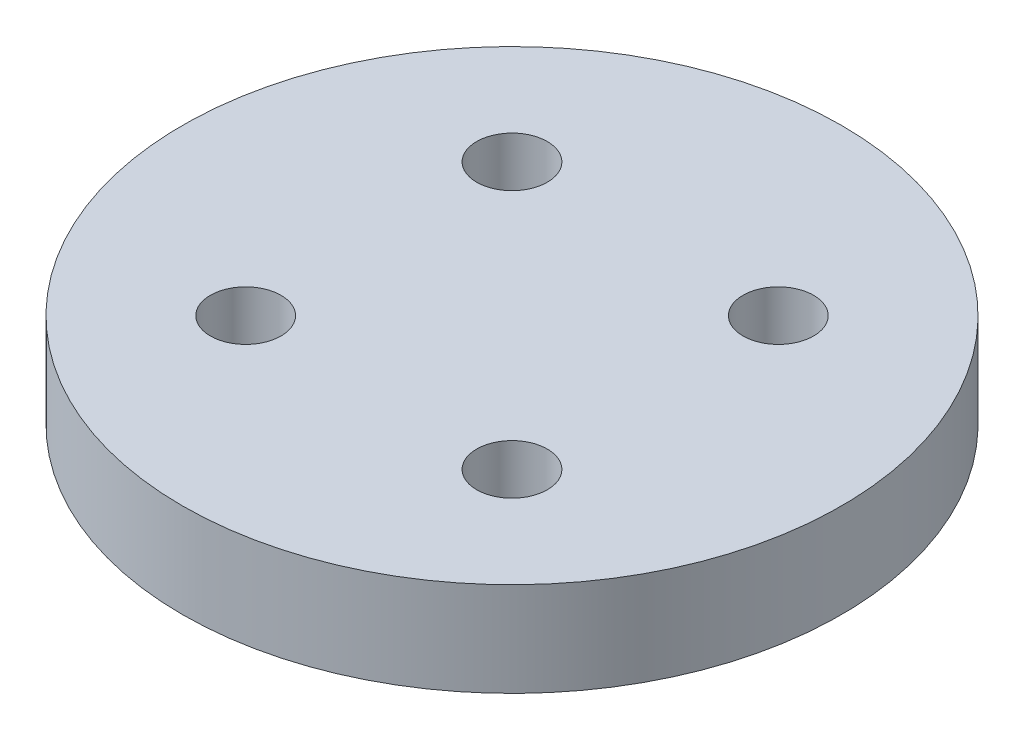
ISO-10303-21;
HEADER;
FILE_DESCRIPTION(('STEP AP214'),'2;1');
FILE_NAME('part.step','',(''),(''),'','','');
FILE_SCHEMA(('AUTOMOTIVE_DESIGN { 1 0 10303 214 1 1 1 1 }'));
ENDSEC;
DATA;
#1=APPLICATION_CONTEXT('core data for automotive mechanical design processes');
#2=APPLICATION_PROTOCOL_DEFINITION('international standard','automotive_design',2000,#1);
#3=PRODUCT_CONTEXT('',#1,'mechanical');
#4=PRODUCT('Part','Part','',(#3));
#5=PRODUCT_RELATED_PRODUCT_CATEGORY('part','',(#4));
#6=PRODUCT_DEFINITION_FORMATION('','',#4);
#7=PRODUCT_DEFINITION_CONTEXT('part definition',#1,'design');
#8=PRODUCT_DEFINITION('design','',#6,#7);
#9=PRODUCT_DEFINITION_SHAPE('','',#8);
#10=(LENGTH_UNIT() NAMED_UNIT(*) SI_UNIT(.MILLI.,.METRE.));
#11=(NAMED_UNIT(*) PLANE_ANGLE_UNIT() SI_UNIT($,.RADIAN.));
#12=(NAMED_UNIT(*) SI_UNIT($,.STERADIAN.) SOLID_ANGLE_UNIT());
#13=UNCERTAINTY_MEASURE_WITH_UNIT(LENGTH_MEASURE(1.E-05),#10,'distance_accuracy_value','');
#14=(GEOMETRIC_REPRESENTATION_CONTEXT(3) GLOBAL_UNCERTAINTY_ASSIGNED_CONTEXT((#13)) GLOBAL_UNIT_ASSIGNED_CONTEXT((#10,
#11,#12)) REPRESENTATION_CONTEXT('',''));
#15=CARTESIAN_POINT('',(0.,0.,0.));
#16=DIRECTION('',(0.,0.,1.));
#17=DIRECTION('',(1.,0.,0.));
#18=AXIS2_PLACEMENT_3D('',#15,#16,#17);
#19=CARTESIAN_POINT('',(0.,4.,0.));
#20=DIRECTION('',(0.,1.,0.));
#21=DIRECTION('',(0.,0.,1.));
#22=AXIS2_PLACEMENT_3D('',#19,#20,#21);
#23=PLANE('',#22);
#24=CARTESIAN_POINT('',(5.65685424949238,4.,5.65685424949238));
#25=DIRECTION('',(0.,1.,0.));
#26=DIRECTION('',(0.,0.,1.));
#27=AXIS2_PLACEMENT_3D('',#24,#25,#26);
#28=CIRCLE('',#27,1.5);
#29=CARTESIAN_POINT('',(5.65685424949238,4.,7.15685424949238));
#30=VERTEX_POINT('',#29);
#31=EDGE_CURVE('E57',#30,#30,#28,.T.);
#32=ORIENTED_EDGE('',*,*,#31,.F.);
#33=EDGE_LOOP('',(#32));
#34=FACE_BOUND('',#33,.T.);
#35=CARTESIAN_POINT('',(-5.65685424949238,4.,-5.65685424949238));
#36=DIRECTION('',(0.,1.,0.));
#37=DIRECTION('',(0.,0.,1.));
#38=AXIS2_PLACEMENT_3D('',#35,#36,#37);
#39=CIRCLE('',#38,1.5);
#40=CARTESIAN_POINT('',(-5.65685424949238,4.,-4.15685424949238));
#41=VERTEX_POINT('',#40);
#42=EDGE_CURVE('E46',#41,#41,#39,.T.);
#43=ORIENTED_EDGE('',*,*,#42,.F.);
#44=EDGE_LOOP('',(#43));
#45=FACE_BOUND('',#44,.T.);
#46=CARTESIAN_POINT('',(0.,4.,0.));
#47=DIRECTION('',(0.,1.,0.));
#48=DIRECTION('',(0.,0.,1.));
#49=AXIS2_PLACEMENT_3D('',#46,#47,#48);
#50=CIRCLE('',#49,14.);
#51=CARTESIAN_POINT('',(0.,4.,14.));
#52=VERTEX_POINT('',#51);
#53=EDGE_CURVE('E10',#52,#52,#50,.T.);
#54=ORIENTED_EDGE('',*,*,#53,.T.);
#55=EDGE_LOOP('',(#54));
#56=FACE_BOUND('',#55,.T.);
#57=CARTESIAN_POINT('',(5.65685424949238,4.,-5.65685424949238));
#58=DIRECTION('',(0.,1.,0.));
#59=DIRECTION('',(0.,0.,1.));
#60=AXIS2_PLACEMENT_3D('',#57,#58,#59);
#61=CIRCLE('',#60,1.5);
#62=CARTESIAN_POINT('',(5.65685424949238,4.,-4.15685424949238));
#63=VERTEX_POINT('',#62);
#64=EDGE_CURVE('E51',#63,#63,#61,.T.);
#65=ORIENTED_EDGE('',*,*,#64,.F.);
#66=EDGE_LOOP('',(#65));
#67=FACE_BOUND('',#66,.T.);
#68=CARTESIAN_POINT('',(-5.65685424949238,4.,5.65685424949238));
#69=DIRECTION('',(0.,1.,0.));
#70=DIRECTION('',(0.,0.,1.));
#71=AXIS2_PLACEMENT_3D('',#68,#69,#70);
#72=CIRCLE('',#71,1.5);
#73=CARTESIAN_POINT('',(-5.65685424949238,4.,7.15685424949238));
#74=VERTEX_POINT('',#73);
#75=EDGE_CURVE('E63',#74,#74,#72,.T.);
#76=ORIENTED_EDGE('',*,*,#75,.F.);
#77=EDGE_LOOP('',(#76));
#78=FACE_BOUND('',#77,.T.);
#79=ADVANCED_FACE('F35',(#34,#45,#56,#67,#78),#23,.T.);
#80=CARTESIAN_POINT('',(0.,0.,0.));
#81=DIRECTION('',(0.,1.,0.));
#82=DIRECTION('',(0.,0.,1.));
#83=AXIS2_PLACEMENT_3D('',#80,#81,#82);
#84=PLANE('',#83);
#85=CARTESIAN_POINT('',(0.,0.,0.));
#86=DIRECTION('',(0.,1.,0.));
#87=DIRECTION('',(0.,0.,1.));
#88=AXIS2_PLACEMENT_3D('',#85,#86,#87);
#89=CIRCLE('',#88,14.);
#90=CARTESIAN_POINT('',(0.,0.,14.));
#91=VERTEX_POINT('',#90);
#92=EDGE_CURVE('E39',#91,#91,#89,.T.);
#93=ORIENTED_EDGE('',*,*,#92,.F.);
#94=EDGE_LOOP('',(#93));
#95=FACE_BOUND('',#94,.T.);
#96=CARTESIAN_POINT('',(-5.65685424949238,0.,-5.65685424949238));
#97=DIRECTION('',(0.,1.,0.));
#98=DIRECTION('',(0.,0.,1.));
#99=AXIS2_PLACEMENT_3D('',#96,#97,#98);
#100=CIRCLE('',#99,1.5);
#101=CARTESIAN_POINT('',(-5.65685424949238,0.,-4.15685424949238));
#102=VERTEX_POINT('',#101);
#103=EDGE_CURVE('E48',#102,#102,#100,.T.);
#104=ORIENTED_EDGE('',*,*,#103,.T.);
#105=EDGE_LOOP('',(#104));
#106=FACE_BOUND('',#105,.T.);
#107=CARTESIAN_POINT('',(5.65685424949238,0.,-5.65685424949238));
#108=DIRECTION('',(0.,1.,0.));
#109=DIRECTION('',(0.,0.,1.));
#110=AXIS2_PLACEMENT_3D('',#107,#108,#109);
#111=CIRCLE('',#110,1.5);
#112=CARTESIAN_POINT('',(5.65685424949238,0.,-4.15685424949238));
#113=VERTEX_POINT('',#112);
#114=EDGE_CURVE('E54',#113,#113,#111,.T.);
#115=ORIENTED_EDGE('',*,*,#114,.T.);
#116=EDGE_LOOP('',(#115));
#117=FACE_BOUND('',#116,.T.);
#118=CARTESIAN_POINT('',(5.65685424949238,0.,5.65685424949238));
#119=DIRECTION('',(0.,1.,0.));
#120=DIRECTION('',(0.,0.,1.));
#121=AXIS2_PLACEMENT_3D('',#118,#119,#120);
#122=CIRCLE('',#121,1.5);
#123=CARTESIAN_POINT('',(5.65685424949238,0.,7.15685424949238));
#124=VERTEX_POINT('',#123);
#125=EDGE_CURVE('E60',#124,#124,#122,.T.);
#126=ORIENTED_EDGE('',*,*,#125,.T.);
#127=EDGE_LOOP('',(#126));
#128=FACE_BOUND('',#127,.T.);
#129=CARTESIAN_POINT('',(-5.65685424949238,0.,5.65685424949238));
#130=DIRECTION('',(0.,1.,0.));
#131=DIRECTION('',(0.,0.,1.));
#132=AXIS2_PLACEMENT_3D('',#129,#130,#131);
#133=CIRCLE('',#132,1.5);
#134=CARTESIAN_POINT('',(-5.65685424949238,0.,7.15685424949238));
#135=VERTEX_POINT('',#134);
#136=EDGE_CURVE('E66',#135,#135,#133,.T.);
#137=ORIENTED_EDGE('',*,*,#136,.T.);
#138=EDGE_LOOP('',(#137));
#139=FACE_BOUND('',#138,.T.);
#140=ADVANCED_FACE('F76',(#95,#106,#117,#128,#139),#84,.F.);
#141=CARTESIAN_POINT('',(0.,4.,0.));
#142=DIRECTION('',(0.,-1.,0.));
#143=DIRECTION('',(0.,0.,-1.));
#144=AXIS2_PLACEMENT_3D('',#141,#142,#143);
#145=CYLINDRICAL_SURFACE('',#144,14.);
#146=ORIENTED_EDGE('',*,*,#53,.F.);
#147=EDGE_LOOP('',(#146));
#148=FACE_BOUND('',#147,.T.);
#149=ORIENTED_EDGE('',*,*,#92,.T.);
#150=EDGE_LOOP('',(#149));
#151=FACE_BOUND('',#150,.T.);
#152=ADVANCED_FACE('F37',(#148,#151),#145,.T.);
#153=CARTESIAN_POINT('',(-5.65685424949238,4.,-5.65685424949238));
#154=DIRECTION('',(0.,-1.,0.));
#155=DIRECTION('',(0.,0.,-1.));
#156=AXIS2_PLACEMENT_3D('',#153,#154,#155);
#157=CYLINDRICAL_SURFACE('',#156,1.5);
#158=ORIENTED_EDGE('',*,*,#42,.T.);
#159=EDGE_LOOP('',(#158));
#160=FACE_BOUND('',#159,.T.);
#161=ORIENTED_EDGE('',*,*,#103,.F.);
#162=EDGE_LOOP('',(#161));
#163=FACE_BOUND('',#162,.T.);
#164=ADVANCED_FACE('F86',(#160,#163),#157,.F.);
#165=CARTESIAN_POINT('',(5.65685424949238,4.,-5.65685424949238));
#166=DIRECTION('',(0.,-1.,0.));
#167=DIRECTION('',(0.,0.,-1.));
#168=AXIS2_PLACEMENT_3D('',#165,#166,#167);
#169=CYLINDRICAL_SURFACE('',#168,1.5);
#170=ORIENTED_EDGE('',*,*,#64,.T.);
#171=EDGE_LOOP('',(#170));
#172=FACE_BOUND('',#171,.T.);
#173=ORIENTED_EDGE('',*,*,#114,.F.);
#174=EDGE_LOOP('',(#173));
#175=FACE_BOUND('',#174,.T.);
#176=ADVANCED_FACE('F89',(#172,#175),#169,.F.);
#177=CARTESIAN_POINT('',(5.65685424949238,4.,5.65685424949238));
#178=DIRECTION('',(0.,-1.,0.));
#179=DIRECTION('',(0.,0.,-1.));
#180=AXIS2_PLACEMENT_3D('',#177,#178,#179);
#181=CYLINDRICAL_SURFACE('',#180,1.5);
#182=ORIENTED_EDGE('',*,*,#31,.T.);
#183=EDGE_LOOP('',(#182));
#184=FACE_BOUND('',#183,.T.);
#185=ORIENTED_EDGE('',*,*,#125,.F.);
#186=EDGE_LOOP('',(#185));
#187=FACE_BOUND('',#186,.T.);
#188=ADVANCED_FACE('F93',(#184,#187),#181,.F.);
#189=CARTESIAN_POINT('',(-5.65685424949238,4.,5.65685424949238));
#190=DIRECTION('',(0.,-1.,0.));
#191=DIRECTION('',(0.,0.,-1.));
#192=AXIS2_PLACEMENT_3D('',#189,#190,#191);
#193=CYLINDRICAL_SURFACE('',#192,1.5);
#194=ORIENTED_EDGE('',*,*,#75,.T.);
#195=EDGE_LOOP('',(#194));
#196=FACE_BOUND('',#195,.T.);
#197=ORIENTED_EDGE('',*,*,#136,.F.);
#198=EDGE_LOOP('',(#197));
#199=FACE_BOUND('',#198,.T.);
#200=ADVANCED_FACE('F72',(#196,#199),#193,.F.);
#201=CLOSED_SHELL('',(#79,#140,#152,#164,#176,#188,#200));
#202=MANIFOLD_SOLID_BREP('B2',#201);
#203=ADVANCED_BREP_SHAPE_REPRESENTATION('',(#18,#202),#14);
#204=SHAPE_DEFINITION_REPRESENTATION(#9,#203);
ENDSEC;
END-ISO-10303-21;
